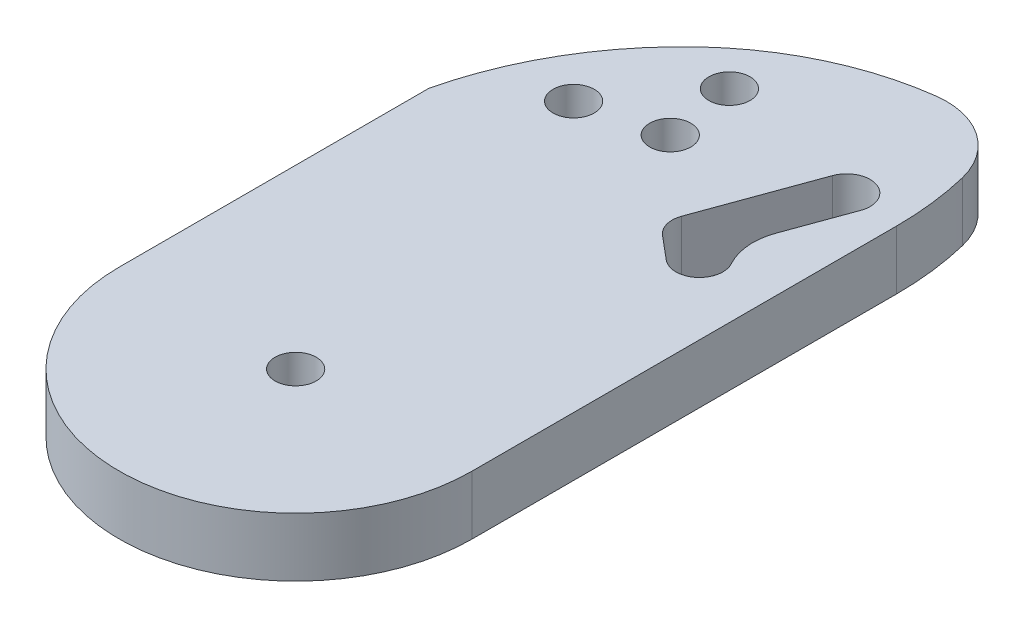
ISO-10303-21;
HEADER;
FILE_DESCRIPTION(('STEP AP214'),'2;1');
FILE_NAME('part.step','',(''),(''),'','','');
FILE_SCHEMA(('AUTOMOTIVE_DESIGN { 1 0 10303 214 1 1 1 1 }'));
ENDSEC;
DATA;
#1=APPLICATION_CONTEXT('core data for automotive mechanical design processes');
#2=APPLICATION_PROTOCOL_DEFINITION('international standard','automotive_design',2000,#1);
#3=PRODUCT_CONTEXT('',#1,'mechanical');
#4=PRODUCT('Part','Part','',(#3));
#5=PRODUCT_RELATED_PRODUCT_CATEGORY('part','',(#4));
#6=PRODUCT_DEFINITION_FORMATION('','',#4);
#7=PRODUCT_DEFINITION_CONTEXT('part definition',#1,'design');
#8=PRODUCT_DEFINITION('design','',#6,#7);
#9=PRODUCT_DEFINITION_SHAPE('','',#8);
#10=(LENGTH_UNIT() NAMED_UNIT(*) SI_UNIT(.MILLI.,.METRE.));
#11=(NAMED_UNIT(*) PLANE_ANGLE_UNIT() SI_UNIT($,.RADIAN.));
#12=(NAMED_UNIT(*) SI_UNIT($,.STERADIAN.) SOLID_ANGLE_UNIT());
#13=UNCERTAINTY_MEASURE_WITH_UNIT(LENGTH_MEASURE(1.E-05),#10,'distance_accuracy_value','');
#14=(GEOMETRIC_REPRESENTATION_CONTEXT(3) GLOBAL_UNCERTAINTY_ASSIGNED_CONTEXT((#13)) GLOBAL_UNIT_ASSIGNED_CONTEXT((#10,
#11,#12)) REPRESENTATION_CONTEXT('',''));
#15=CARTESIAN_POINT('',(0.,0.,0.));
#16=DIRECTION('',(0.,0.,1.));
#17=DIRECTION('',(1.,0.,0.));
#18=AXIS2_PLACEMENT_3D('',#15,#16,#17);
#19=CARTESIAN_POINT('',(0.,5.,0.));
#20=DIRECTION('',(0.,1.,0.));
#21=DIRECTION('',(0.,0.,1.));
#22=AXIS2_PLACEMENT_3D('',#19,#20,#21);
#23=PLANE('',#22);
#24=CARTESIAN_POINT('',(-7.90591950617081,5.,-31.5197648568308));
#25=DIRECTION('',(0.,1.,0.));
#26=DIRECTION('',(0.,0.,1.));
#27=AXIS2_PLACEMENT_3D('',#24,#25,#26);
#28=CIRCLE('',#27,1.75);
#29=CARTESIAN_POINT('',(-7.90591950617081,5.,-29.7697648568308));
#30=VERTEX_POINT('',#29);
#31=EDGE_CURVE('E409',#30,#30,#28,.T.);
#32=ORIENTED_EDGE('',*,*,#31,.F.);
#33=EDGE_LOOP('',(#32));
#34=FACE_BOUND('',#33,.T.);
#35=CARTESIAN_POINT('',(-2.20712771461398,5.,-39.0574093951377));
#36=DIRECTION('',(0.,1.,0.));
#37=DIRECTION('',(0.,0.,1.));
#38=AXIS2_PLACEMENT_3D('',#35,#36,#37);
#39=CIRCLE('',#38,1.75);
#40=CARTESIAN_POINT('',(-2.20712771461398,5.,-37.3074093951377));
#41=VERTEX_POINT('',#40);
#42=EDGE_CURVE('E408',#41,#41,#39,.T.);
#43=ORIENTED_EDGE('',*,*,#42,.F.);
#44=EDGE_LOOP('',(#43));
#45=FACE_BOUND('',#44,.T.);
#46=CARTESIAN_POINT('',(-1.30177895180411,5.,-33.1261073780694));
#47=DIRECTION('',(0.,1.,0.));
#48=DIRECTION('',(0.,0.,1.));
#49=AXIS2_PLACEMENT_3D('',#46,#47,#48);
#50=CIRCLE('',#49,1.75);
#51=CARTESIAN_POINT('',(-1.30177895180411,5.,-31.3761073780694));
#52=VERTEX_POINT('',#51);
#53=EDGE_CURVE('E277',#52,#52,#50,.T.);
#54=ORIENTED_EDGE('',*,*,#53,.F.);
#55=EDGE_LOOP('',(#54));
#56=FACE_BOUND('',#55,.T.);
#57=CARTESIAN_POINT('',(0.,5.,0.));
#58=DIRECTION('',(0.,1.,0.));
#59=DIRECTION('',(0.,0.,1.));
#60=AXIS2_PLACEMENT_3D('',#57,#58,#59);
#61=CIRCLE('',#60,1.75);
#62=CARTESIAN_POINT('',(0.,5.,1.75));
#63=VERTEX_POINT('',#62);
#64=EDGE_CURVE('E179',#63,#63,#61,.T.);
#65=ORIENTED_EDGE('',*,*,#64,.F.);
#66=EDGE_LOOP('',(#65));
#67=FACE_BOUND('',#66,.T.);
#68=DIRECTION('',(-0.342020143325663,0.,0.939692620785911));
#69=VECTOR('',#68,1.);
#70=CARTESIAN_POINT('',(-0.58153391039172,5.,-0.211661033599011));
#71=LINE('',#70,#69);
#72=CARTESIAN_POINT('',(12.3245001175966,5.,-35.6706981002107));
#73=VERTEX_POINT('',#72);
#74=CARTESIAN_POINT('',(10.4140875809569,5.,-30.4218827939499));
#75=VERTEX_POINT('',#74);
#76=EDGE_CURVE('E186',#73,#75,#71,.T.);
#77=ORIENTED_EDGE('',*,*,#76,.T.);
#78=CARTESIAN_POINT('',(15.1125506848865,5.,-28.7117820773216));
#79=DIRECTION('',(0.,1.,0.));
#80=DIRECTION('',(0.,0.,1.));
#81=AXIS2_PLACEMENT_3D('',#78,#79,#80);
#82=CIRCLE('',#81,5.);
#83=CARTESIAN_POINT('',(10.7464430528247,5.,-26.2751647201537));
#84=VERTEX_POINT('',#83);
#85=EDGE_CURVE('E259',#75,#84,#82,.T.);
#86=ORIENTED_EDGE('',*,*,#85,.T.);
#87=CARTESIAN_POINT('',(9.,5.,-25.3005177772865));
#88=DIRECTION('',(0.,1.,0.));
#89=DIRECTION('',(0.,0.,1.));
#90=AXIS2_PLACEMENT_3D('',#87,#88,#89);
#91=CIRCLE('',#90,2.);
#92=CARTESIAN_POINT('',(7.71442478062693,5.,-23.7684288910486));
#93=VERTEX_POINT('',#92);
#94=EDGE_CURVE('E229',#93,#84,#91,.T.);
#95=ORIENTED_EDGE('',*,*,#94,.F.);
#96=DIRECTION('',(0.766044443118985,0.,0.642787609686531));
#97=VECTOR('',#96,1.);
#98=CARTESIAN_POINT('',(14.8910810122731,5.,-17.7464992939883));
#99=LINE('',#98,#97);
#100=CARTESIAN_POINT('',(5.73933822339513,5.,-25.4257232927649));
#101=VERTEX_POINT('',#100);
#102=EDGE_CURVE('E358',#101,#93,#99,.T.);
#103=ORIENTED_EDGE('',*,*,#102,.F.);
#104=CARTESIAN_POINT('',(7.02491344276819,5.,-26.9578121790029));
#105=DIRECTION('',(0.,1.,0.));
#106=DIRECTION('',(0.,0.,1.));
#107=AXIS2_PLACEMENT_3D('',#104,#105,#106);
#108=CIRCLE('',#107,2.);
#109=CARTESIAN_POINT('',(5.14552820119637,5.,-27.6418524656542));
#110=VERTEX_POINT('',#109);
#111=EDGE_CURVE('E377',#110,#101,#108,.T.);
#112=ORIENTED_EDGE('',*,*,#111,.F.);
#113=DIRECTION('',(-0.342020143325662,0.,0.939692620785911));
#114=VECTOR('',#113,1.);
#115=CARTESIAN_POINT('',(-4.34030439353535,5.,-1.57974160690165));
#116=LINE('',#115,#114);
#117=CARTESIAN_POINT('',(8.56572963445299,5.,-37.0387786735133));
#118=VERTEX_POINT('',#117);
#119=EDGE_CURVE('E373',#118,#110,#116,.T.);
#120=ORIENTED_EDGE('',*,*,#119,.F.);
#121=CARTESIAN_POINT('',(10.4451148760249,5.,-36.354738386862));
#122=DIRECTION('',(0.,1.,0.));
#123=DIRECTION('',(0.,0.,1.));
#124=AXIS2_PLACEMENT_3D('',#121,#122,#123);
#125=CIRCLE('',#124,2.);
#126=EDGE_CURVE('E368',#73,#118,#125,.T.);
#127=ORIENTED_EDGE('',*,*,#126,.F.);
#128=EDGE_LOOP('',(#77,#86,#95,#103,#112,#120,#127));
#129=FACE_BOUND('',#128,.T.);
#130=CARTESIAN_POINT('',(-12.0433926946577,5.,-36.0469907387137));
#131=DIRECTION('',(0.,-1.,0.));
#132=DIRECTION('',(0.,0.,1.));
#133=AXIS2_PLACEMENT_3D('',#130,#131,#132);
#134=CIRCLE('',#133,27.0433926946577);
#135=CARTESIAN_POINT('',(14.2432435242057,5.,-42.3997731790783));
#136=VERTEX_POINT('',#135);
#137=CARTESIAN_POINT('',(15.,5.,-36.0469907387136));
#138=VERTEX_POINT('',#137);
#139=EDGE_CURVE('E148',#136,#138,#134,.T.);
#140=ORIENTED_EDGE('',*,*,#139,.F.);
#141=CARTESIAN_POINT('',(7.95930078320732,5.,-40.8811109672649));
#142=DIRECTION('',(0.,-1.,0.));
#143=DIRECTION('',(0.,0.,1.));
#144=AXIS2_PLACEMENT_3D('',#141,#142,#143);
#145=CIRCLE('',#144,6.46484889890984);
#146=CARTESIAN_POINT('',(7.1270724023176,5.,-47.2921691644565));
#147=VERTEX_POINT('',#146);
#148=EDGE_CURVE('E171',#147,#136,#145,.T.);
#149=ORIENTED_EDGE('',*,*,#148,.F.);
#150=CARTESIAN_POINT('',(10.3077401020891,5.,-22.789945739485));
#151=DIRECTION('',(0.,-1.,0.));
#152=DIRECTION('',(0.,0.,1.));
#153=AXIS2_PLACEMENT_3D('',#150,#151,#152);
#154=CIRCLE('',#153,24.707804430657);
#155=CARTESIAN_POINT('',(-6.48402665532397,5.,-40.9148503998751));
#156=VERTEX_POINT('',#155);
#157=EDGE_CURVE('E399',#156,#147,#154,.T.);
#158=ORIENTED_EDGE('',*,*,#157,.F.);
#159=CARTESIAN_POINT('',(13.2458473139737,5.,-19.6185752775946));
#160=DIRECTION('',(0.,-1.,0.));
#161=DIRECTION('',(0.,0.,1.));
#162=AXIS2_PLACEMENT_3D('',#159,#160,#161);
#163=CIRCLE('',#162,29.0310051656541);
#164=CARTESIAN_POINT('',(-15.,5.,-26.3246449494605));
#165=VERTEX_POINT('',#164);
#166=EDGE_CURVE('E159',#165,#156,#163,.T.);
#167=ORIENTED_EDGE('',*,*,#166,.F.);
#168=DIRECTION('',(0.,0.,-1.));
#169=VECTOR('',#168,1.);
#170=CARTESIAN_POINT('',(-15.,5.,0.));
#171=LINE('',#170,#169);
#172=CARTESIAN_POINT('',(-15.,5.,0.));
#173=VERTEX_POINT('',#172);
#174=EDGE_CURVE('E178',#173,#165,#171,.T.);
#175=ORIENTED_EDGE('',*,*,#174,.F.);
#176=CARTESIAN_POINT('',(0.,5.,0.));
#177=DIRECTION('',(0.,1.,0.));
#178=DIRECTION('',(0.,0.,1.));
#179=AXIS2_PLACEMENT_3D('',#176,#177,#178);
#180=CIRCLE('',#179,15.);
#181=CARTESIAN_POINT('',(15.,5.,0.));
#182=VERTEX_POINT('',#181);
#183=EDGE_CURVE('E175',#173,#182,#180,.T.);
#184=ORIENTED_EDGE('',*,*,#183,.T.);
#185=DIRECTION('',(0.,0.,-1.));
#186=VECTOR('',#185,1.);
#187=CARTESIAN_POINT('',(15.,5.,0.));
#188=LINE('',#187,#186);
#189=EDGE_CURVE('E166',#182,#138,#188,.T.);
#190=ORIENTED_EDGE('',*,*,#189,.T.);
#191=EDGE_LOOP('',(#140,#149,#158,#167,#175,#184,#190));
#192=FACE_BOUND('',#191,.T.);
#193=ADVANCED_FACE('F43',(#34,#45,#56,#67,#129,#192),#23,.T.);
#194=CARTESIAN_POINT('',(0.,0.,0.));
#195=DIRECTION('',(0.,1.,0.));
#196=DIRECTION('',(0.,0.,1.));
#197=AXIS2_PLACEMENT_3D('',#194,#195,#196);
#198=PLANE('',#197);
#199=CARTESIAN_POINT('',(-7.90591950617081,0.,-31.5197648568308));
#200=DIRECTION('',(0.,1.,0.));
#201=DIRECTION('',(0.,0.,1.));
#202=AXIS2_PLACEMENT_3D('',#199,#200,#201);
#203=CIRCLE('',#202,1.75);
#204=CARTESIAN_POINT('',(-7.90591950617081,0.,-29.7697648568308));
#205=VERTEX_POINT('',#204);
#206=EDGE_CURVE('E47',#205,#205,#203,.T.);
#207=ORIENTED_EDGE('',*,*,#206,.T.);
#208=EDGE_LOOP('',(#207));
#209=FACE_BOUND('',#208,.T.);
#210=CARTESIAN_POINT('',(-2.20712771461398,0.,-39.0574093951377));
#211=DIRECTION('',(0.,1.,0.));
#212=DIRECTION('',(0.,0.,1.));
#213=AXIS2_PLACEMENT_3D('',#210,#211,#212);
#214=CIRCLE('',#213,1.75);
#215=CARTESIAN_POINT('',(-2.20712771461398,0.,-37.3074093951377));
#216=VERTEX_POINT('',#215);
#217=EDGE_CURVE('E276',#216,#216,#214,.T.);
#218=ORIENTED_EDGE('',*,*,#217,.T.);
#219=EDGE_LOOP('',(#218));
#220=FACE_BOUND('',#219,.T.);
#221=CARTESIAN_POINT('',(-1.30177895180411,0.,-33.1261073780694));
#222=DIRECTION('',(0.,1.,0.));
#223=DIRECTION('',(0.,0.,1.));
#224=AXIS2_PLACEMENT_3D('',#221,#222,#223);
#225=CIRCLE('',#224,1.75);
#226=CARTESIAN_POINT('',(-1.30177895180411,0.,-31.3761073780694));
#227=VERTEX_POINT('',#226);
#228=EDGE_CURVE('E273',#227,#227,#225,.T.);
#229=ORIENTED_EDGE('',*,*,#228,.T.);
#230=EDGE_LOOP('',(#229));
#231=FACE_BOUND('',#230,.T.);
#232=CARTESIAN_POINT('',(9.,0.,-25.3005177772865));
#233=DIRECTION('',(0.,1.,0.));
#234=DIRECTION('',(0.,0.,1.));
#235=AXIS2_PLACEMENT_3D('',#232,#233,#234);
#236=CIRCLE('',#235,2.);
#237=CARTESIAN_POINT('',(7.71442478062693,0.,-23.7684288910486));
#238=VERTEX_POINT('',#237);
#239=CARTESIAN_POINT('',(10.7464430528247,0.,-26.2751647201537));
#240=VERTEX_POINT('',#239);
#241=EDGE_CURVE('E193',#238,#240,#236,.T.);
#242=ORIENTED_EDGE('',*,*,#241,.T.);
#243=CARTESIAN_POINT('',(15.1125506848865,0.,-28.7117820773216));
#244=DIRECTION('',(0.,1.,0.));
#245=DIRECTION('',(0.,0.,1.));
#246=AXIS2_PLACEMENT_3D('',#243,#244,#245);
#247=CIRCLE('',#246,5.);
#248=CARTESIAN_POINT('',(10.4140875809569,0.,-30.4218827939499));
#249=VERTEX_POINT('',#248);
#250=EDGE_CURVE('E254',#240,#249,#247,.F.);
#251=ORIENTED_EDGE('',*,*,#250,.T.);
#252=DIRECTION('',(-0.342020143325663,0.,0.939692620785911));
#253=VECTOR('',#252,1.);
#254=CARTESIAN_POINT('',(-0.58153391039172,0.,-0.211661033599011));
#255=LINE('',#254,#253);
#256=CARTESIAN_POINT('',(12.3245001175966,0.,-35.6706981002107));
#257=VERTEX_POINT('',#256);
#258=EDGE_CURVE('E213',#257,#249,#255,.T.);
#259=ORIENTED_EDGE('',*,*,#258,.F.);
#260=CARTESIAN_POINT('',(10.4451148760249,0.,-36.354738386862));
#261=DIRECTION('',(0.,1.,0.));
#262=DIRECTION('',(0.,0.,1.));
#263=AXIS2_PLACEMENT_3D('',#260,#261,#262);
#264=CIRCLE('',#263,2.);
#265=CARTESIAN_POINT('',(8.56572963445299,0.,-37.0387786735133));
#266=VERTEX_POINT('',#265);
#267=EDGE_CURVE('E209',#257,#266,#264,.T.);
#268=ORIENTED_EDGE('',*,*,#267,.T.);
#269=DIRECTION('',(-0.342020143325662,0.,0.939692620785911));
#270=VECTOR('',#269,1.);
#271=CARTESIAN_POINT('',(-4.34030439353535,0.,-1.57974160690165));
#272=LINE('',#271,#270);
#273=CARTESIAN_POINT('',(5.14552820119637,0.,-27.6418524656542));
#274=VERTEX_POINT('',#273);
#275=EDGE_CURVE('E205',#266,#274,#272,.T.);
#276=ORIENTED_EDGE('',*,*,#275,.T.);
#277=CARTESIAN_POINT('',(7.02491344276819,0.,-26.9578121790029));
#278=DIRECTION('',(0.,1.,0.));
#279=DIRECTION('',(0.,0.,1.));
#280=AXIS2_PLACEMENT_3D('',#277,#278,#279);
#281=CIRCLE('',#280,2.);
#282=CARTESIAN_POINT('',(5.73933822339513,0.,-25.4257232927649));
#283=VERTEX_POINT('',#282);
#284=EDGE_CURVE('E201',#274,#283,#281,.T.);
#285=ORIENTED_EDGE('',*,*,#284,.T.);
#286=DIRECTION('',(0.766044443118985,0.,0.642787609686531));
#287=VECTOR('',#286,1.);
#288=CARTESIAN_POINT('',(14.8910810122731,0.,-17.7464992939883));
#289=LINE('',#288,#287);
#290=EDGE_CURVE('E197',#283,#238,#289,.T.);
#291=ORIENTED_EDGE('',*,*,#290,.T.);
#292=EDGE_LOOP('',(#242,#251,#259,#268,#276,#285,#291));
#293=FACE_BOUND('',#292,.T.);
#294=CARTESIAN_POINT('',(0.,0.,0.));
#295=DIRECTION('',(0.,1.,0.));
#296=DIRECTION('',(0.,0.,1.));
#297=AXIS2_PLACEMENT_3D('',#294,#295,#296);
#298=CIRCLE('',#297,1.75);
#299=CARTESIAN_POINT('',(0.,0.,1.75));
#300=VERTEX_POINT('',#299);
#301=EDGE_CURVE('E216',#300,#300,#298,.T.);
#302=ORIENTED_EDGE('',*,*,#301,.T.);
#303=EDGE_LOOP('',(#302));
#304=FACE_BOUND('',#303,.T.);
#305=CARTESIAN_POINT('',(7.95930078320732,0.,-40.8811109672649));
#306=DIRECTION('',(0.,1.,0.));
#307=DIRECTION('',(0.,0.,1.));
#308=AXIS2_PLACEMENT_3D('',#305,#306,#307);
#309=CIRCLE('',#308,6.46484889890984);
#310=CARTESIAN_POINT('',(7.1270724023176,0.,-47.2921691644565));
#311=VERTEX_POINT('',#310);
#312=CARTESIAN_POINT('',(14.2432435242057,0.,-42.3997731790783));
#313=VERTEX_POINT('',#312);
#314=EDGE_CURVE('E53',#311,#313,#309,.F.);
#315=ORIENTED_EDGE('',*,*,#314,.T.);
#316=CARTESIAN_POINT('',(-12.0433926946577,0.,-36.0469907387137));
#317=DIRECTION('',(0.,1.,0.));
#318=DIRECTION('',(0.,0.,1.));
#319=AXIS2_PLACEMENT_3D('',#316,#317,#318);
#320=CIRCLE('',#319,27.0433926946577);
#321=CARTESIAN_POINT('',(15.,0.,-36.0469907387136));
#322=VERTEX_POINT('',#321);
#323=EDGE_CURVE('E11',#313,#322,#320,.F.);
#324=ORIENTED_EDGE('',*,*,#323,.T.);
#325=DIRECTION('',(0.,0.,-1.));
#326=VECTOR('',#325,1.);
#327=CARTESIAN_POINT('',(15.,0.,0.));
#328=LINE('',#327,#326);
#329=CARTESIAN_POINT('',(15.,0.,0.));
#330=VERTEX_POINT('',#329);
#331=EDGE_CURVE('E168',#330,#322,#328,.T.);
#332=ORIENTED_EDGE('',*,*,#331,.F.);
#333=CARTESIAN_POINT('',(0.,0.,0.));
#334=DIRECTION('',(0.,1.,0.));
#335=DIRECTION('',(0.,0.,1.));
#336=AXIS2_PLACEMENT_3D('',#333,#334,#335);
#337=CIRCLE('',#336,15.);
#338=CARTESIAN_POINT('',(-15.,0.,0.));
#339=VERTEX_POINT('',#338);
#340=EDGE_CURVE('E226',#339,#330,#337,.T.);
#341=ORIENTED_EDGE('',*,*,#340,.F.);
#342=DIRECTION('',(0.,0.,-1.));
#343=VECTOR('',#342,1.);
#344=CARTESIAN_POINT('',(-15.,0.,0.));
#345=LINE('',#344,#343);
#346=CARTESIAN_POINT('',(-15.,0.,-26.3246449494605));
#347=VERTEX_POINT('',#346);
#348=EDGE_CURVE('E222',#339,#347,#345,.T.);
#349=ORIENTED_EDGE('',*,*,#348,.T.);
#350=CARTESIAN_POINT('',(13.2458473139737,0.,-19.6185752775946));
#351=DIRECTION('',(0.,1.,0.));
#352=DIRECTION('',(0.,0.,1.));
#353=AXIS2_PLACEMENT_3D('',#350,#351,#352);
#354=CIRCLE('',#353,29.0310051656541);
#355=CARTESIAN_POINT('',(-6.48402665532398,0.,-40.9148503998751));
#356=VERTEX_POINT('',#355);
#357=EDGE_CURVE('E262',#347,#356,#354,.F.);
#358=ORIENTED_EDGE('',*,*,#357,.T.);
#359=CARTESIAN_POINT('',(10.3077401020891,0.,-22.789945739485));
#360=DIRECTION('',(0.,1.,0.));
#361=DIRECTION('',(0.,0.,1.));
#362=AXIS2_PLACEMENT_3D('',#359,#360,#361);
#363=CIRCLE('',#362,24.707804430657);
#364=EDGE_CURVE('E266',#356,#311,#363,.F.);
#365=ORIENTED_EDGE('',*,*,#364,.T.);
#366=EDGE_LOOP('',(#315,#324,#332,#341,#349,#358,#365));
#367=FACE_BOUND('',#366,.T.);
#368=ADVANCED_FACE('F286',(#209,#220,#231,#293,#304,#367),#198,.F.);
#369=CARTESIAN_POINT('',(15.,5.,0.));
#370=DIRECTION('',(-1.,0.,0.));
#371=DIRECTION('',(0.,0.,1.));
#372=AXIS2_PLACEMENT_3D('',#369,#370,#371);
#373=PLANE('',#372);
#374=ORIENTED_EDGE('',*,*,#331,.T.);
#375=DIRECTION('',(0.,1.,0.));
#376=VECTOR('',#375,1.);
#377=CARTESIAN_POINT('',(15.,-5.,-36.0469907387136));
#378=LINE('',#377,#376);
#379=EDGE_CURVE('E151',#322,#138,#378,.T.);
#380=ORIENTED_EDGE('',*,*,#379,.T.);
#381=ORIENTED_EDGE('',*,*,#189,.F.);
#382=DIRECTION('',(0.,-1.,0.));
#383=VECTOR('',#382,1.);
#384=CARTESIAN_POINT('',(15.,5.,0.));
#385=LINE('',#384,#383);
#386=EDGE_CURVE('E230',#182,#330,#385,.T.);
#387=ORIENTED_EDGE('',*,*,#386,.T.);
#388=EDGE_LOOP('',(#374,#380,#381,#387));
#389=FACE_BOUND('',#388,.T.);
#390=ADVANCED_FACE('F164',(#389),#373,.F.);
#391=CARTESIAN_POINT('',(-15.,5.,0.));
#392=DIRECTION('',(-1.,0.,0.));
#393=DIRECTION('',(0.,0.,1.));
#394=AXIS2_PLACEMENT_3D('',#391,#392,#393);
#395=PLANE('',#394);
#396=DIRECTION('',(0.,1.,0.));
#397=VECTOR('',#396,1.);
#398=CARTESIAN_POINT('',(-15.,-5.,-26.3246449494605));
#399=LINE('',#398,#397);
#400=EDGE_CURVE('E170',#347,#165,#399,.T.);
#401=ORIENTED_EDGE('',*,*,#400,.F.);
#402=ORIENTED_EDGE('',*,*,#348,.F.);
#403=DIRECTION('',(0.,-1.,0.));
#404=VECTOR('',#403,1.);
#405=CARTESIAN_POINT('',(-15.,5.,0.));
#406=LINE('',#405,#404);
#407=EDGE_CURVE('E233',#173,#339,#406,.T.);
#408=ORIENTED_EDGE('',*,*,#407,.F.);
#409=ORIENTED_EDGE('',*,*,#174,.T.);
#410=EDGE_LOOP('',(#401,#402,#408,#409));
#411=FACE_BOUND('',#410,.T.);
#412=ADVANCED_FACE('F318',(#411),#395,.T.);
#413=CARTESIAN_POINT('',(9.,5.,-25.3005177772865));
#414=DIRECTION('',(0.,-1.,0.));
#415=DIRECTION('',(0.,0.,-1.));
#416=AXIS2_PLACEMENT_3D('',#413,#414,#415);
#417=CYLINDRICAL_SURFACE('',#416,2.);
#418=ORIENTED_EDGE('',*,*,#94,.T.);
#419=DIRECTION('',(0.,-1.,0.));
#420=VECTOR('',#419,1.);
#421=CARTESIAN_POINT('',(10.7464430528247,5.,-26.2751647201537));
#422=LINE('',#421,#420);
#423=EDGE_CURVE('E237',#84,#240,#422,.T.);
#424=ORIENTED_EDGE('',*,*,#423,.T.);
#425=ORIENTED_EDGE('',*,*,#241,.F.);
#426=DIRECTION('',(0.,-1.,0.));
#427=VECTOR('',#426,1.);
#428=CARTESIAN_POINT('',(7.71442478062693,5.,-23.7684288910486));
#429=LINE('',#428,#427);
#430=EDGE_CURVE('E234',#93,#238,#429,.T.);
#431=ORIENTED_EDGE('',*,*,#430,.F.);
#432=EDGE_LOOP('',(#418,#424,#425,#431));
#433=FACE_BOUND('',#432,.T.);
#434=ADVANCED_FACE('F321',(#433),#417,.F.);
#435=CARTESIAN_POINT('',(14.8910810122731,5.,-17.7464992939883));
#436=DIRECTION('',(0.642787609686531,0.,-0.766044443118985));
#437=DIRECTION('',(-0.766044443118985,0.,-0.642787609686531));
#438=AXIS2_PLACEMENT_3D('',#435,#436,#437);
#439=PLANE('',#438);
#440=ORIENTED_EDGE('',*,*,#290,.F.);
#441=DIRECTION('',(0.,-1.,0.));
#442=VECTOR('',#441,1.);
#443=CARTESIAN_POINT('',(5.73933822339513,5.,-25.4257232927649));
#444=LINE('',#443,#442);
#445=EDGE_CURVE('E246',#101,#283,#444,.T.);
#446=ORIENTED_EDGE('',*,*,#445,.F.);
#447=ORIENTED_EDGE('',*,*,#102,.T.);
#448=ORIENTED_EDGE('',*,*,#430,.T.);
#449=EDGE_LOOP('',(#440,#446,#447,#448));
#450=FACE_BOUND('',#449,.T.);
#451=ADVANCED_FACE('F342',(#450),#439,.T.);
#452=CARTESIAN_POINT('',(7.02491344276819,5.,-26.9578121790029));
#453=DIRECTION('',(0.,-1.,0.));
#454=DIRECTION('',(0.,0.,-1.));
#455=AXIS2_PLACEMENT_3D('',#452,#453,#454);
#456=CYLINDRICAL_SURFACE('',#455,2.);
#457=ORIENTED_EDGE('',*,*,#284,.F.);
#458=DIRECTION('',(0.,-1.,0.));
#459=VECTOR('',#458,1.);
#460=CARTESIAN_POINT('',(5.14552820119637,5.,-27.6418524656542));
#461=LINE('',#460,#459);
#462=EDGE_CURVE('E243',#110,#274,#461,.T.);
#463=ORIENTED_EDGE('',*,*,#462,.F.);
#464=ORIENTED_EDGE('',*,*,#111,.T.);
#465=ORIENTED_EDGE('',*,*,#445,.T.);
#466=EDGE_LOOP('',(#457,#463,#464,#465));
#467=FACE_BOUND('',#466,.T.);
#468=ADVANCED_FACE('F338',(#467),#456,.F.);
#469=CARTESIAN_POINT('',(-4.34030439353535,5.,-1.57974160690165));
#470=DIRECTION('',(0.939692620785911,0.,0.342020143325662));
#471=DIRECTION('',(0.342020143325662,0.,-0.939692620785911));
#472=AXIS2_PLACEMENT_3D('',#469,#470,#471);
#473=PLANE('',#472);
#474=ORIENTED_EDGE('',*,*,#275,.F.);
#475=DIRECTION('',(0.,-1.,0.));
#476=VECTOR('',#475,1.);
#477=CARTESIAN_POINT('',(8.56572963445299,5.,-37.0387786735133));
#478=LINE('',#477,#476);
#479=EDGE_CURVE('E240',#118,#266,#478,.T.);
#480=ORIENTED_EDGE('',*,*,#479,.F.);
#481=ORIENTED_EDGE('',*,*,#119,.T.);
#482=ORIENTED_EDGE('',*,*,#462,.T.);
#483=EDGE_LOOP('',(#474,#480,#481,#482));
#484=FACE_BOUND('',#483,.T.);
#485=ADVANCED_FACE('F334',(#484),#473,.T.);
#486=CARTESIAN_POINT('',(10.4451148760249,5.,-36.354738386862));
#487=DIRECTION('',(0.,-1.,0.));
#488=DIRECTION('',(0.,0.,-1.));
#489=AXIS2_PLACEMENT_3D('',#486,#487,#488);
#490=CYLINDRICAL_SURFACE('',#489,2.);
#491=ORIENTED_EDGE('',*,*,#267,.F.);
#492=DIRECTION('',(0.,-1.,0.));
#493=VECTOR('',#492,1.);
#494=CARTESIAN_POINT('',(12.3245001175966,5.,-35.6706981002107));
#495=LINE('',#494,#493);
#496=EDGE_CURVE('E192',#73,#257,#495,.T.);
#497=ORIENTED_EDGE('',*,*,#496,.F.);
#498=ORIENTED_EDGE('',*,*,#126,.T.);
#499=ORIENTED_EDGE('',*,*,#479,.T.);
#500=EDGE_LOOP('',(#491,#497,#498,#499));
#501=FACE_BOUND('',#500,.T.);
#502=ADVANCED_FACE('F331',(#501),#490,.F.);
#503=CARTESIAN_POINT('',(-0.58153391039172,5.,-0.211661033599011));
#504=DIRECTION('',(0.93969262078591,0.,0.342020143325663));
#505=DIRECTION('',(0.342020143325663,0.,-0.93969262078591));
#506=AXIS2_PLACEMENT_3D('',#503,#504,#505);
#507=PLANE('',#506);
#508=ORIENTED_EDGE('',*,*,#258,.T.);
#509=DIRECTION('',(0.,1.,0.));
#510=VECTOR('',#509,1.);
#511=CARTESIAN_POINT('',(10.4140875809569,5.,-30.4218827939499));
#512=LINE('',#511,#510);
#513=EDGE_CURVE('E69',#249,#75,#512,.T.);
#514=ORIENTED_EDGE('',*,*,#513,.T.);
#515=ORIENTED_EDGE('',*,*,#76,.F.);
#516=ORIENTED_EDGE('',*,*,#496,.T.);
#517=EDGE_LOOP('',(#508,#514,#515,#516));
#518=FACE_BOUND('',#517,.T.);
#519=ADVANCED_FACE('F327',(#518),#507,.F.);
#520=CARTESIAN_POINT('',(0.,5.,0.));
#521=DIRECTION('',(0.,-1.,0.));
#522=DIRECTION('',(0.,0.,-1.));
#523=AXIS2_PLACEMENT_3D('',#520,#521,#522);
#524=CYLINDRICAL_SURFACE('',#523,1.75);
#525=ORIENTED_EDGE('',*,*,#64,.T.);
#526=EDGE_LOOP('',(#525));
#527=FACE_BOUND('',#526,.T.);
#528=ORIENTED_EDGE('',*,*,#301,.F.);
#529=EDGE_LOOP('',(#528));
#530=FACE_BOUND('',#529,.T.);
#531=ADVANCED_FACE('F316',(#527,#530),#524,.F.);
#532=CARTESIAN_POINT('',(0.,5.,0.));
#533=DIRECTION('',(0.,-1.,0.));
#534=DIRECTION('',(0.,0.,-1.));
#535=AXIS2_PLACEMENT_3D('',#532,#533,#534);
#536=CYLINDRICAL_SURFACE('',#535,15.);
#537=ORIENTED_EDGE('',*,*,#340,.T.);
#538=ORIENTED_EDGE('',*,*,#386,.F.);
#539=ORIENTED_EDGE('',*,*,#183,.F.);
#540=ORIENTED_EDGE('',*,*,#407,.T.);
#541=EDGE_LOOP('',(#537,#538,#539,#540));
#542=FACE_BOUND('',#541,.T.);
#543=ADVANCED_FACE('F313',(#542),#536,.T.);
#544=CARTESIAN_POINT('',(15.1125506848865,5.,-28.7117820773216));
#545=DIRECTION('',(0.,-1.,0.));
#546=DIRECTION('',(0.,0.,-1.));
#547=AXIS2_PLACEMENT_3D('',#544,#545,#546);
#548=CYLINDRICAL_SURFACE('',#547,5.);
#549=ORIENTED_EDGE('',*,*,#85,.F.);
#550=ORIENTED_EDGE('',*,*,#513,.F.);
#551=ORIENTED_EDGE('',*,*,#250,.F.);
#552=ORIENTED_EDGE('',*,*,#423,.F.);
#553=EDGE_LOOP('',(#549,#550,#551,#552));
#554=FACE_BOUND('',#553,.T.);
#555=ADVANCED_FACE('F45',(#554),#548,.T.);
#556=CARTESIAN_POINT('',(-12.0433926946577,-5.,-36.0469907387137));
#557=DIRECTION('',(0.,1.,0.));
#558=DIRECTION('',(0.,0.,1.));
#559=AXIS2_PLACEMENT_3D('',#556,#557,#558);
#560=CYLINDRICAL_SURFACE('',#559,27.0433926946577);
#561=DIRECTION('',(0.,1.,0.));
#562=VECTOR('',#561,1.);
#563=CARTESIAN_POINT('',(14.2432435242057,-5.,-42.3997731790783));
#564=LINE('',#563,#562);
#565=EDGE_CURVE('E153',#313,#136,#564,.T.);
#566=ORIENTED_EDGE('',*,*,#565,.T.);
#567=ORIENTED_EDGE('',*,*,#139,.T.);
#568=ORIENTED_EDGE('',*,*,#379,.F.);
#569=ORIENTED_EDGE('',*,*,#323,.F.);
#570=EDGE_LOOP('',(#566,#567,#568,#569));
#571=FACE_BOUND('',#570,.T.);
#572=ADVANCED_FACE('F150',(#571),#560,.T.);
#573=CARTESIAN_POINT('',(7.95930078320732,-5.,-40.8811109672649));
#574=DIRECTION('',(0.,1.,0.));
#575=DIRECTION('',(0.,0.,1.));
#576=AXIS2_PLACEMENT_3D('',#573,#574,#575);
#577=CYLINDRICAL_SURFACE('',#576,6.46484889890984);
#578=DIRECTION('',(0.,1.,0.));
#579=VECTOR('',#578,1.);
#580=CARTESIAN_POINT('',(7.1270724023176,-5.,-47.2921691644565));
#581=LINE('',#580,#579);
#582=EDGE_CURVE('E392',#311,#147,#581,.T.);
#583=ORIENTED_EDGE('',*,*,#582,.T.);
#584=ORIENTED_EDGE('',*,*,#148,.T.);
#585=ORIENTED_EDGE('',*,*,#565,.F.);
#586=ORIENTED_EDGE('',*,*,#314,.F.);
#587=EDGE_LOOP('',(#583,#584,#585,#586));
#588=FACE_BOUND('',#587,.T.);
#589=ADVANCED_FACE('F425',(#588),#577,.T.);
#590=CARTESIAN_POINT('',(10.3077401020891,-5.,-22.789945739485));
#591=DIRECTION('',(0.,1.,0.));
#592=DIRECTION('',(0.,0.,1.));
#593=AXIS2_PLACEMENT_3D('',#590,#591,#592);
#594=CYLINDRICAL_SURFACE('',#593,24.707804430657);
#595=DIRECTION('',(0.,1.,0.));
#596=VECTOR('',#595,1.);
#597=CARTESIAN_POINT('',(-6.48402665532397,-5.,-40.9148503998751));
#598=LINE('',#597,#596);
#599=EDGE_CURVE('E61',#356,#156,#598,.T.);
#600=ORIENTED_EDGE('',*,*,#599,.T.);
#601=ORIENTED_EDGE('',*,*,#157,.T.);
#602=ORIENTED_EDGE('',*,*,#582,.F.);
#603=ORIENTED_EDGE('',*,*,#364,.F.);
#604=EDGE_LOOP('',(#600,#601,#602,#603));
#605=FACE_BOUND('',#604,.T.);
#606=ADVANCED_FACE('F427',(#605),#594,.T.);
#607=CARTESIAN_POINT('',(13.2458473139737,-5.,-19.6185752775946));
#608=DIRECTION('',(0.,1.,0.));
#609=DIRECTION('',(0.,0.,1.));
#610=AXIS2_PLACEMENT_3D('',#607,#608,#609);
#611=CYLINDRICAL_SURFACE('',#610,29.0310051656541);
#612=ORIENTED_EDGE('',*,*,#400,.T.);
#613=ORIENTED_EDGE('',*,*,#166,.T.);
#614=ORIENTED_EDGE('',*,*,#599,.F.);
#615=ORIENTED_EDGE('',*,*,#357,.F.);
#616=EDGE_LOOP('',(#612,#613,#614,#615));
#617=FACE_BOUND('',#616,.T.);
#618=ADVANCED_FACE('F433',(#617),#611,.T.);
#619=CARTESIAN_POINT('',(-1.30177895180411,-5.,-33.1261073780694));
#620=DIRECTION('',(0.,1.,0.));
#621=DIRECTION('',(0.,0.,1.));
#622=AXIS2_PLACEMENT_3D('',#619,#620,#621);
#623=CYLINDRICAL_SURFACE('',#622,1.75);
#624=ORIENTED_EDGE('',*,*,#53,.T.);
#625=EDGE_LOOP('',(#624));
#626=FACE_BOUND('',#625,.T.);
#627=ORIENTED_EDGE('',*,*,#228,.F.);
#628=EDGE_LOOP('',(#627));
#629=FACE_BOUND('',#628,.T.);
#630=ADVANCED_FACE('F296',(#626,#629),#623,.F.);
#631=CARTESIAN_POINT('',(-2.20712771461398,-5.,-39.0574093951377));
#632=DIRECTION('',(0.,1.,0.));
#633=DIRECTION('',(0.,0.,1.));
#634=AXIS2_PLACEMENT_3D('',#631,#632,#633);
#635=CYLINDRICAL_SURFACE('',#634,1.75);
#636=ORIENTED_EDGE('',*,*,#42,.T.);
#637=EDGE_LOOP('',(#636));
#638=FACE_BOUND('',#637,.T.);
#639=ORIENTED_EDGE('',*,*,#217,.F.);
#640=EDGE_LOOP('',(#639));
#641=FACE_BOUND('',#640,.T.);
#642=ADVANCED_FACE('F290',(#638,#641),#635,.F.);
#643=CARTESIAN_POINT('',(-7.90591950617081,-5.,-31.5197648568308));
#644=DIRECTION('',(0.,1.,0.));
#645=DIRECTION('',(0.,0.,1.));
#646=AXIS2_PLACEMENT_3D('',#643,#644,#645);
#647=CYLINDRICAL_SURFACE('',#646,1.75);
#648=ORIENTED_EDGE('',*,*,#31,.T.);
#649=EDGE_LOOP('',(#648));
#650=FACE_BOUND('',#649,.T.);
#651=ORIENTED_EDGE('',*,*,#206,.F.);
#652=EDGE_LOOP('',(#651));
#653=FACE_BOUND('',#652,.T.);
#654=ADVANCED_FACE('F288',(#650,#653),#647,.F.);
#655=CLOSED_SHELL('',(#193,#368,#390,#412,#434,#451,#468,#485,#502,#519,#531,#543,#555,#572,
#589,#606,#618,#630,#642,#654));
#656=MANIFOLD_SOLID_BREP('B2',#655);
#657=ADVANCED_BREP_SHAPE_REPRESENTATION('',(#18,#656),#14);
#658=SHAPE_DEFINITION_REPRESENTATION(#9,#657);
ENDSEC;
END-ISO-10303-21;
